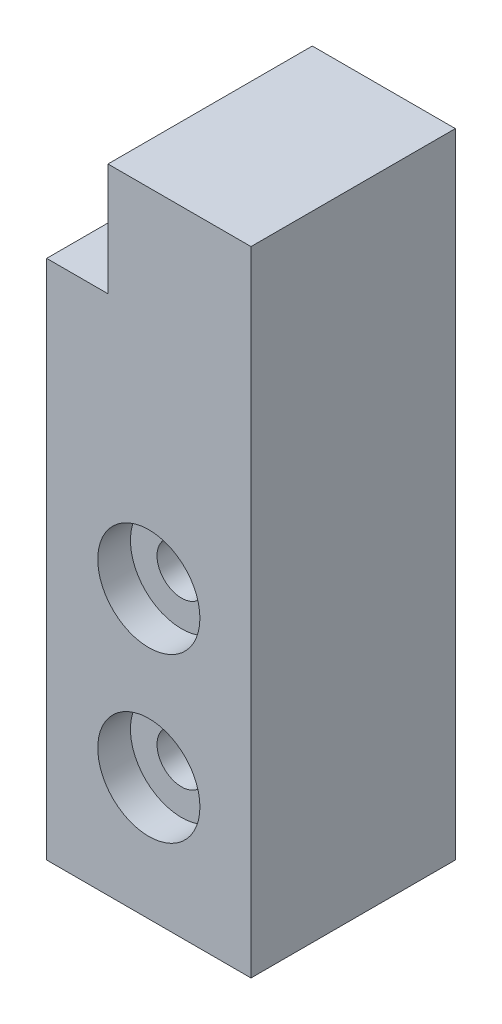
ISO-10303-21;
HEADER;
FILE_DESCRIPTION(('STEP AP214'),'2;1');
FILE_NAME('part.step','',(''),(''),'','','');
FILE_SCHEMA(('AUTOMOTIVE_DESIGN { 1 0 10303 214 1 1 1 1 }'));
ENDSEC;
DATA;
#1=APPLICATION_CONTEXT('core data for automotive mechanical design processes');
#2=APPLICATION_PROTOCOL_DEFINITION('international standard','automotive_design',2000,#1);
#3=PRODUCT_CONTEXT('',#1,'mechanical');
#4=PRODUCT('Part','Part','',(#3));
#5=PRODUCT_RELATED_PRODUCT_CATEGORY('part','',(#4));
#6=PRODUCT_DEFINITION_FORMATION('','',#4);
#7=PRODUCT_DEFINITION_CONTEXT('part definition',#1,'design');
#8=PRODUCT_DEFINITION('design','',#6,#7);
#9=PRODUCT_DEFINITION_SHAPE('','',#8);
#10=(LENGTH_UNIT() NAMED_UNIT(*) SI_UNIT(.MILLI.,.METRE.));
#11=(NAMED_UNIT(*) PLANE_ANGLE_UNIT() SI_UNIT($,.RADIAN.));
#12=(NAMED_UNIT(*) SI_UNIT($,.STERADIAN.) SOLID_ANGLE_UNIT());
#13=UNCERTAINTY_MEASURE_WITH_UNIT(LENGTH_MEASURE(1.E-05),#10,'distance_accuracy_value','');
#14=(GEOMETRIC_REPRESENTATION_CONTEXT(3) GLOBAL_UNCERTAINTY_ASSIGNED_CONTEXT((#13)) GLOBAL_UNIT_ASSIGNED_CONTEXT((#10,
#11,#12)) REPRESENTATION_CONTEXT('',''));
#15=CARTESIAN_POINT('',(0.,0.,0.));
#16=DIRECTION('',(0.,0.,1.));
#17=DIRECTION('',(1.,0.,0.));
#18=AXIS2_PLACEMENT_3D('',#15,#16,#17);
#19=CARTESIAN_POINT('',(0.,0.,10.));
#20=DIRECTION('',(1.,0.,0.));
#21=DIRECTION('',(0.,0.,-1.));
#22=AXIS2_PLACEMENT_3D('',#19,#20,#21);
#23=PLANE('',#22);
#24=DIRECTION('',(0.,-1.,0.));
#25=VECTOR('',#24,1.);
#26=CARTESIAN_POINT('',(0.,0.,10.));
#27=LINE('',#26,#25);
#28=CARTESIAN_POINT('',(0.,25.5,10.));
#29=VERTEX_POINT('',#28);
#30=CARTESIAN_POINT('',(0.,0.,10.));
#31=VERTEX_POINT('',#30);
#32=EDGE_CURVE('E80',#29,#31,#27,.T.);
#33=ORIENTED_EDGE('',*,*,#32,.F.);
#34=DIRECTION('',(0.,0.,1.));
#35=VECTOR('',#34,1.);
#36=CARTESIAN_POINT('',(0.,25.5,0.));
#37=LINE('',#36,#35);
#38=CARTESIAN_POINT('',(0.,25.5,0.));
#39=VERTEX_POINT('',#38);
#40=EDGE_CURVE('E100',#39,#29,#37,.T.);
#41=ORIENTED_EDGE('',*,*,#40,.F.);
#42=DIRECTION('',(0.,-1.,0.));
#43=VECTOR('',#42,1.);
#44=CARTESIAN_POINT('',(0.,0.,0.));
#45=LINE('',#44,#43);
#46=CARTESIAN_POINT('',(0.,0.,0.));
#47=VERTEX_POINT('',#46);
#48=EDGE_CURVE('E108',#39,#47,#45,.T.);
#49=ORIENTED_EDGE('',*,*,#48,.T.);
#50=DIRECTION('',(0.,0.,-1.));
#51=VECTOR('',#50,1.);
#52=CARTESIAN_POINT('',(0.,0.,10.));
#53=LINE('',#52,#51);
#54=EDGE_CURVE('E11',#31,#47,#53,.T.);
#55=ORIENTED_EDGE('',*,*,#54,.F.);
#56=EDGE_LOOP('',(#33,#41,#49,#55));
#57=FACE_BOUND('',#56,.T.);
#58=ADVANCED_FACE('F35',(#57),#23,.F.);
#59=CARTESIAN_POINT('',(0.,0.,10.));
#60=DIRECTION('',(0.,1.,0.));
#61=DIRECTION('',(0.,0.,1.));
#62=AXIS2_PLACEMENT_3D('',#59,#60,#61);
#63=PLANE('',#62);
#64=DIRECTION('',(1.,0.,0.));
#65=VECTOR('',#64,1.);
#66=CARTESIAN_POINT('',(0.,0.,0.));
#67=LINE('',#66,#65);
#68=CARTESIAN_POINT('',(10.,0.,0.));
#69=VERTEX_POINT('',#68);
#70=EDGE_CURVE('E112',#47,#69,#67,.T.);
#71=ORIENTED_EDGE('',*,*,#70,.T.);
#72=DIRECTION('',(0.,0.,-1.));
#73=VECTOR('',#72,1.);
#74=CARTESIAN_POINT('',(10.,0.,10.));
#75=LINE('',#74,#73);
#76=CARTESIAN_POINT('',(10.,0.,10.));
#77=VERTEX_POINT('',#76);
#78=EDGE_CURVE('E42',#77,#69,#75,.T.);
#79=ORIENTED_EDGE('',*,*,#78,.F.);
#80=DIRECTION('',(1.,0.,0.));
#81=VECTOR('',#80,1.);
#82=CARTESIAN_POINT('',(0.,0.,10.));
#83=LINE('',#82,#81);
#84=EDGE_CURVE('E135',#31,#77,#83,.T.);
#85=ORIENTED_EDGE('',*,*,#84,.F.);
#86=ORIENTED_EDGE('',*,*,#54,.T.);
#87=EDGE_LOOP('',(#71,#79,#85,#86));
#88=FACE_BOUND('',#87,.T.);
#89=ADVANCED_FACE('F195',(#88),#63,.F.);
#90=CARTESIAN_POINT('',(10.,0.,10.));
#91=DIRECTION('',(-1.,0.,0.));
#92=DIRECTION('',(0.,0.,1.));
#93=AXIS2_PLACEMENT_3D('',#90,#91,#92);
#94=PLANE('',#93);
#95=DIRECTION('',(0.,1.,0.));
#96=VECTOR('',#95,1.);
#97=CARTESIAN_POINT('',(10.,0.,0.));
#98=LINE('',#97,#96);
#99=CARTESIAN_POINT('',(10.,31.,0.));
#100=VERTEX_POINT('',#99);
#101=EDGE_CURVE('E75',#69,#100,#98,.T.);
#102=ORIENTED_EDGE('',*,*,#101,.T.);
#103=DIRECTION('',(0.,0.,-1.));
#104=VECTOR('',#103,1.);
#105=CARTESIAN_POINT('',(10.,31.,10.));
#106=LINE('',#105,#104);
#107=CARTESIAN_POINT('',(10.,31.,10.));
#108=VERTEX_POINT('',#107);
#109=EDGE_CURVE('E126',#108,#100,#106,.T.);
#110=ORIENTED_EDGE('',*,*,#109,.F.);
#111=DIRECTION('',(0.,1.,0.));
#112=VECTOR('',#111,1.);
#113=CARTESIAN_POINT('',(10.,0.,10.));
#114=LINE('',#113,#112);
#115=EDGE_CURVE('E58',#77,#108,#114,.T.);
#116=ORIENTED_EDGE('',*,*,#115,.F.);
#117=ORIENTED_EDGE('',*,*,#78,.T.);
#118=EDGE_LOOP('',(#102,#110,#116,#117));
#119=FACE_BOUND('',#118,.T.);
#120=ADVANCED_FACE('F128',(#119),#94,.F.);
#121=CARTESIAN_POINT('',(0.,31.,10.));
#122=DIRECTION('',(0.,-1.,0.));
#123=DIRECTION('',(0.,0.,-1.));
#124=AXIS2_PLACEMENT_3D('',#121,#122,#123);
#125=PLANE('',#124);
#126=DIRECTION('',(-1.,0.,0.));
#127=VECTOR('',#126,1.);
#128=CARTESIAN_POINT('',(0.,31.,0.));
#129=LINE('',#128,#127);
#130=CARTESIAN_POINT('',(3.,31.,0.));
#131=VERTEX_POINT('',#130);
#132=EDGE_CURVE('E123',#100,#131,#129,.T.);
#133=ORIENTED_EDGE('',*,*,#132,.T.);
#134=DIRECTION('',(0.,0.,1.));
#135=VECTOR('',#134,1.);
#136=CARTESIAN_POINT('',(3.,31.,0.));
#137=LINE('',#136,#135);
#138=CARTESIAN_POINT('',(3.,31.,10.));
#139=VERTEX_POINT('',#138);
#140=EDGE_CURVE('E113',#131,#139,#137,.T.);
#141=ORIENTED_EDGE('',*,*,#140,.T.);
#142=DIRECTION('',(-1.,0.,0.));
#143=VECTOR('',#142,1.);
#144=CARTESIAN_POINT('',(0.,31.,10.));
#145=LINE('',#144,#143);
#146=EDGE_CURVE('E119',#108,#139,#145,.T.);
#147=ORIENTED_EDGE('',*,*,#146,.F.);
#148=ORIENTED_EDGE('',*,*,#109,.T.);
#149=EDGE_LOOP('',(#133,#141,#147,#148));
#150=FACE_BOUND('',#149,.T.);
#151=ADVANCED_FACE('F132',(#150),#125,.F.);
#152=CARTESIAN_POINT('',(0.,0.,10.));
#153=DIRECTION('',(0.,0.,-1.));
#154=DIRECTION('',(-1.,0.,0.));
#155=AXIS2_PLACEMENT_3D('',#152,#153,#154);
#156=PLANE('',#155);
#157=CARTESIAN_POINT('',(5.,14.,10.));
#158=DIRECTION('',(0.,0.,1.));
#159=DIRECTION('',(1.,0.,0.));
#160=AXIS2_PLACEMENT_3D('',#157,#158,#159);
#161=CIRCLE('',#160,2.5);
#162=CARTESIAN_POINT('',(7.5,14.,10.));
#163=VERTEX_POINT('',#162);
#164=EDGE_CURVE('E165',#163,#163,#161,.T.);
#165=ORIENTED_EDGE('',*,*,#164,.F.);
#166=EDGE_LOOP('',(#165));
#167=FACE_BOUND('',#166,.T.);
#168=CARTESIAN_POINT('',(5.,6.,10.));
#169=DIRECTION('',(0.,0.,1.));
#170=DIRECTION('',(1.,0.,0.));
#171=AXIS2_PLACEMENT_3D('',#168,#169,#170);
#172=CIRCLE('',#171,2.5);
#173=CARTESIAN_POINT('',(7.5,6.,10.));
#174=VERTEX_POINT('',#173);
#175=EDGE_CURVE('E153',#174,#174,#172,.T.);
#176=ORIENTED_EDGE('',*,*,#175,.F.);
#177=EDGE_LOOP('',(#176));
#178=FACE_BOUND('',#177,.T.);
#179=ORIENTED_EDGE('',*,*,#146,.T.);
#180=DIRECTION('',(0.,1.,0.));
#181=VECTOR('',#180,1.);
#182=CARTESIAN_POINT('',(3.,31.,10.));
#183=LINE('',#182,#181);
#184=CARTESIAN_POINT('',(3.,25.5,10.));
#185=VERTEX_POINT('',#184);
#186=EDGE_CURVE('E104',#185,#139,#183,.T.);
#187=ORIENTED_EDGE('',*,*,#186,.F.);
#188=DIRECTION('',(1.,0.,0.));
#189=VECTOR('',#188,1.);
#190=CARTESIAN_POINT('',(0.,25.5,10.));
#191=LINE('',#190,#189);
#192=EDGE_CURVE('E141',#29,#185,#191,.T.);
#193=ORIENTED_EDGE('',*,*,#192,.F.);
#194=ORIENTED_EDGE('',*,*,#32,.T.);
#195=ORIENTED_EDGE('',*,*,#84,.T.);
#196=ORIENTED_EDGE('',*,*,#115,.T.);
#197=EDGE_LOOP('',(#179,#187,#193,#194,#195,#196));
#198=FACE_BOUND('',#197,.T.);
#199=ADVANCED_FACE('F171',(#167,#178,#198),#156,.F.);
#200=CARTESIAN_POINT('',(0.,0.,0.));
#201=DIRECTION('',(0.,0.,-1.));
#202=DIRECTION('',(-1.,0.,0.));
#203=AXIS2_PLACEMENT_3D('',#200,#201,#202);
#204=PLANE('',#203);
#205=CARTESIAN_POINT('',(5.,14.,0.));
#206=DIRECTION('',(0.,0.,1.));
#207=DIRECTION('',(1.,0.,0.));
#208=AXIS2_PLACEMENT_3D('',#205,#206,#207);
#209=CIRCLE('',#208,1.2);
#210=CARTESIAN_POINT('',(6.2,14.,0.));
#211=VERTEX_POINT('',#210);
#212=EDGE_CURVE('E156',#211,#211,#209,.T.);
#213=ORIENTED_EDGE('',*,*,#212,.T.);
#214=EDGE_LOOP('',(#213));
#215=FACE_BOUND('',#214,.T.);
#216=CARTESIAN_POINT('',(5.,6.,0.));
#217=DIRECTION('',(0.,0.,1.));
#218=DIRECTION('',(1.,0.,0.));
#219=AXIS2_PLACEMENT_3D('',#216,#217,#218);
#220=CIRCLE('',#219,1.2);
#221=CARTESIAN_POINT('',(6.2,6.,0.));
#222=VERTEX_POINT('',#221);
#223=EDGE_CURVE('E143',#222,#222,#220,.T.);
#224=ORIENTED_EDGE('',*,*,#223,.T.);
#225=EDGE_LOOP('',(#224));
#226=FACE_BOUND('',#225,.T.);
#227=DIRECTION('',(0.,1.,0.));
#228=VECTOR('',#227,1.);
#229=CARTESIAN_POINT('',(3.,31.,0.));
#230=LINE('',#229,#228);
#231=CARTESIAN_POINT('',(3.,25.5,0.));
#232=VERTEX_POINT('',#231);
#233=EDGE_CURVE('E49',#232,#131,#230,.T.);
#234=ORIENTED_EDGE('',*,*,#233,.T.);
#235=ORIENTED_EDGE('',*,*,#132,.F.);
#236=ORIENTED_EDGE('',*,*,#101,.F.);
#237=ORIENTED_EDGE('',*,*,#70,.F.);
#238=ORIENTED_EDGE('',*,*,#48,.F.);
#239=DIRECTION('',(1.,0.,0.));
#240=VECTOR('',#239,1.);
#241=CARTESIAN_POINT('',(0.,25.5,0.));
#242=LINE('',#241,#240);
#243=EDGE_CURVE('E96',#39,#232,#242,.T.);
#244=ORIENTED_EDGE('',*,*,#243,.T.);
#245=EDGE_LOOP('',(#234,#235,#236,#237,#238,#244));
#246=FACE_BOUND('',#245,.T.);
#247=ADVANCED_FACE('F111',(#215,#226,#246),#204,.T.);
#248=CARTESIAN_POINT('',(3.,31.,0.));
#249=DIRECTION('',(1.,0.,0.));
#250=DIRECTION('',(0.,1.,0.));
#251=AXIS2_PLACEMENT_3D('',#248,#249,#250);
#252=PLANE('',#251);
#253=ORIENTED_EDGE('',*,*,#186,.T.);
#254=ORIENTED_EDGE('',*,*,#140,.F.);
#255=ORIENTED_EDGE('',*,*,#233,.F.);
#256=DIRECTION('',(0.,0.,1.));
#257=VECTOR('',#256,1.);
#258=CARTESIAN_POINT('',(3.,25.5,0.));
#259=LINE('',#258,#257);
#260=EDGE_CURVE('E101',#232,#185,#259,.T.);
#261=ORIENTED_EDGE('',*,*,#260,.T.);
#262=EDGE_LOOP('',(#253,#254,#255,#261));
#263=FACE_BOUND('',#262,.T.);
#264=ADVANCED_FACE('F207',(#263),#252,.F.);
#265=CARTESIAN_POINT('',(0.,25.5,0.));
#266=DIRECTION('',(0.,-1.,0.));
#267=DIRECTION('',(0.,0.,-1.));
#268=AXIS2_PLACEMENT_3D('',#265,#266,#267);
#269=PLANE('',#268);
#270=ORIENTED_EDGE('',*,*,#192,.T.);
#271=ORIENTED_EDGE('',*,*,#260,.F.);
#272=ORIENTED_EDGE('',*,*,#243,.F.);
#273=ORIENTED_EDGE('',*,*,#40,.T.);
#274=EDGE_LOOP('',(#270,#271,#272,#273));
#275=FACE_BOUND('',#274,.T.);
#276=ADVANCED_FACE('F99',(#275),#269,.F.);
#277=CARTESIAN_POINT('',(5.,6.,10.));
#278=DIRECTION('',(0.,0.,1.));
#279=DIRECTION('',(1.,0.,0.));
#280=AXIS2_PLACEMENT_3D('',#277,#278,#279);
#281=CYLINDRICAL_SURFACE('',#280,1.2);
#282=ORIENTED_EDGE('',*,*,#223,.F.);
#283=EDGE_LOOP('',(#282));
#284=FACE_BOUND('',#283,.T.);
#285=CARTESIAN_POINT('',(5.,6.,8.4));
#286=DIRECTION('',(0.,0.,1.));
#287=DIRECTION('',(1.,0.,0.));
#288=AXIS2_PLACEMENT_3D('',#285,#286,#287);
#289=CIRCLE('',#288,1.2);
#290=CARTESIAN_POINT('',(6.2,6.,8.4));
#291=VERTEX_POINT('',#290);
#292=EDGE_CURVE('E147',#291,#291,#289,.T.);
#293=ORIENTED_EDGE('',*,*,#292,.T.);
#294=EDGE_LOOP('',(#293));
#295=FACE_BOUND('',#294,.T.);
#296=ADVANCED_FACE('F190',(#284,#295),#281,.F.);
#297=CARTESIAN_POINT('',(6.2,6.,8.4));
#298=DIRECTION('',(0.,0.,-1.));
#299=DIRECTION('',(-1.,0.,0.));
#300=AXIS2_PLACEMENT_3D('',#297,#298,#299);
#301=PLANE('',#300);
#302=ORIENTED_EDGE('',*,*,#292,.F.);
#303=EDGE_LOOP('',(#302));
#304=FACE_BOUND('',#303,.T.);
#305=CARTESIAN_POINT('',(5.,6.,8.4));
#306=DIRECTION('',(0.,0.,1.));
#307=DIRECTION('',(1.,0.,0.));
#308=AXIS2_PLACEMENT_3D('',#305,#306,#307);
#309=CIRCLE('',#308,2.5);
#310=CARTESIAN_POINT('',(7.5,6.,8.4));
#311=VERTEX_POINT('',#310);
#312=EDGE_CURVE('E150',#311,#311,#309,.T.);
#313=ORIENTED_EDGE('',*,*,#312,.T.);
#314=EDGE_LOOP('',(#313));
#315=FACE_BOUND('',#314,.T.);
#316=ADVANCED_FACE('F180',(#304,#315),#301,.F.);
#317=CARTESIAN_POINT('',(5.,6.,10.));
#318=DIRECTION('',(0.,0.,1.));
#319=DIRECTION('',(1.,0.,0.));
#320=AXIS2_PLACEMENT_3D('',#317,#318,#319);
#321=CYLINDRICAL_SURFACE('',#320,2.5);
#322=ORIENTED_EDGE('',*,*,#312,.F.);
#323=EDGE_LOOP('',(#322));
#324=FACE_BOUND('',#323,.T.);
#325=ORIENTED_EDGE('',*,*,#175,.T.);
#326=EDGE_LOOP('',(#325));
#327=FACE_BOUND('',#326,.T.);
#328=ADVANCED_FACE('F177',(#324,#327),#321,.F.);
#329=CARTESIAN_POINT('',(5.,14.,10.));
#330=DIRECTION('',(0.,0.,1.));
#331=DIRECTION('',(1.,0.,0.));
#332=AXIS2_PLACEMENT_3D('',#329,#330,#331);
#333=CYLINDRICAL_SURFACE('',#332,1.2);
#334=ORIENTED_EDGE('',*,*,#212,.F.);
#335=EDGE_LOOP('',(#334));
#336=FACE_BOUND('',#335,.T.);
#337=CARTESIAN_POINT('',(5.,14.,8.4));
#338=DIRECTION('',(0.,0.,1.));
#339=DIRECTION('',(1.,0.,0.));
#340=AXIS2_PLACEMENT_3D('',#337,#338,#339);
#341=CIRCLE('',#340,1.2);
#342=CARTESIAN_POINT('',(6.2,14.,8.4));
#343=VERTEX_POINT('',#342);
#344=EDGE_CURVE('E159',#343,#343,#341,.T.);
#345=ORIENTED_EDGE('',*,*,#344,.T.);
#346=EDGE_LOOP('',(#345));
#347=FACE_BOUND('',#346,.T.);
#348=ADVANCED_FACE('F179',(#336,#347),#333,.F.);
#349=CARTESIAN_POINT('',(6.2,14.,8.4));
#350=DIRECTION('',(0.,0.,-1.));
#351=DIRECTION('',(-1.,0.,0.));
#352=AXIS2_PLACEMENT_3D('',#349,#350,#351);
#353=PLANE('',#352);
#354=ORIENTED_EDGE('',*,*,#344,.F.);
#355=EDGE_LOOP('',(#354));
#356=FACE_BOUND('',#355,.T.);
#357=CARTESIAN_POINT('',(5.,14.,8.4));
#358=DIRECTION('',(0.,0.,1.));
#359=DIRECTION('',(1.,0.,0.));
#360=AXIS2_PLACEMENT_3D('',#357,#358,#359);
#361=CIRCLE('',#360,2.5);
#362=CARTESIAN_POINT('',(7.5,14.,8.4));
#363=VERTEX_POINT('',#362);
#364=EDGE_CURVE('E162',#363,#363,#361,.T.);
#365=ORIENTED_EDGE('',*,*,#364,.T.);
#366=EDGE_LOOP('',(#365));
#367=FACE_BOUND('',#366,.T.);
#368=ADVANCED_FACE('F187',(#356,#367),#353,.F.);
#369=CARTESIAN_POINT('',(5.,14.,10.));
#370=DIRECTION('',(0.,0.,1.));
#371=DIRECTION('',(1.,0.,0.));
#372=AXIS2_PLACEMENT_3D('',#369,#370,#371);
#373=CYLINDRICAL_SURFACE('',#372,2.5);
#374=ORIENTED_EDGE('',*,*,#364,.F.);
#375=EDGE_LOOP('',(#374));
#376=FACE_BOUND('',#375,.T.);
#377=ORIENTED_EDGE('',*,*,#164,.T.);
#378=EDGE_LOOP('',(#377));
#379=FACE_BOUND('',#378,.T.);
#380=ADVANCED_FACE('F169',(#376,#379),#373,.F.);
#381=CLOSED_SHELL('',(#58,#89,#120,#151,#199,#247,#264,#276,#296,#316,#328,#348,#368,#380));
#382=MANIFOLD_SOLID_BREP('B2',#381);
#383=ADVANCED_BREP_SHAPE_REPRESENTATION('',(#18,#382),#14);
#384=SHAPE_DEFINITION_REPRESENTATION(#9,#383);
ENDSEC;
END-ISO-10303-21;
